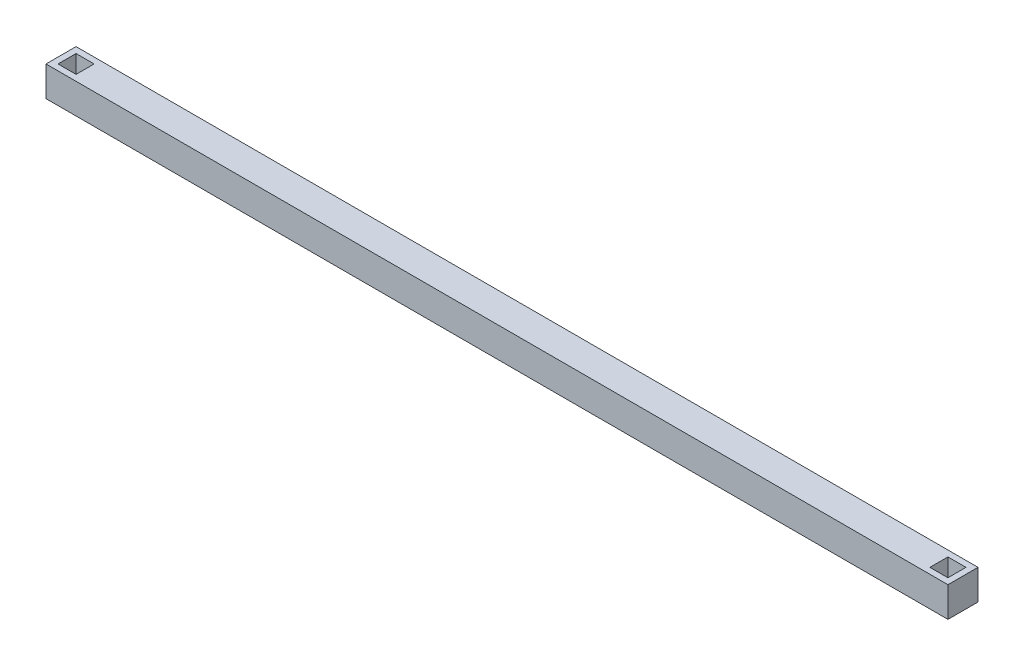
ISO-10303-21;
HEADER;
FILE_DESCRIPTION(('STEP AP214'),'2;1');
FILE_NAME('part.step','',(''),(''),'','','');
FILE_SCHEMA(('AUTOMOTIVE_DESIGN { 1 0 10303 214 1 1 1 1 }'));
ENDSEC;
DATA;
#1=APPLICATION_CONTEXT('core data for automotive mechanical design processes');
#2=APPLICATION_PROTOCOL_DEFINITION('international standard','automotive_design',2000,#1);
#3=PRODUCT_CONTEXT('',#1,'mechanical');
#4=PRODUCT('Part','Part','',(#3));
#5=PRODUCT_RELATED_PRODUCT_CATEGORY('part','',(#4));
#6=PRODUCT_DEFINITION_FORMATION('','',#4);
#7=PRODUCT_DEFINITION_CONTEXT('part definition',#1,'design');
#8=PRODUCT_DEFINITION('design','',#6,#7);
#9=PRODUCT_DEFINITION_SHAPE('','',#8);
#10=(LENGTH_UNIT() NAMED_UNIT(*) SI_UNIT(.MILLI.,.METRE.));
#11=(NAMED_UNIT(*) PLANE_ANGLE_UNIT() SI_UNIT($,.RADIAN.));
#12=(NAMED_UNIT(*) SI_UNIT($,.STERADIAN.) SOLID_ANGLE_UNIT());
#13=UNCERTAINTY_MEASURE_WITH_UNIT(LENGTH_MEASURE(1.E-05),#10,'distance_accuracy_value','');
#14=(GEOMETRIC_REPRESENTATION_CONTEXT(3) GLOBAL_UNCERTAINTY_ASSIGNED_CONTEXT((#13)) GLOBAL_UNIT_ASSIGNED_CONTEXT((#10,
#11,#12)) REPRESENTATION_CONTEXT('',''));
#15=CARTESIAN_POINT('',(0.,0.,0.));
#16=DIRECTION('',(0.,0.,1.));
#17=DIRECTION('',(1.,0.,0.));
#18=AXIS2_PLACEMENT_3D('',#15,#16,#17);
#19=CARTESIAN_POINT('',(-750.,25.,50.));
#20=DIRECTION('',(0.,-1.,0.));
#21=DIRECTION('',(0.,0.,-1.));
#22=AXIS2_PLACEMENT_3D('',#19,#20,#21);
#23=PLANE('',#22);
#24=DIRECTION('',(1.,0.,0.));
#25=VECTOR('',#24,1.);
#26=CARTESIAN_POINT('',(-740.,25.,10.));
#27=LINE('',#26,#25);
#28=CARTESIAN_POINT('',(-740.,25.,10.));
#29=VERTEX_POINT('',#28);
#30=CARTESIAN_POINT('',(-710.,25.,10.));
#31=VERTEX_POINT('',#30);
#32=EDGE_CURVE('E57',#29,#31,#27,.T.);
#33=ORIENTED_EDGE('',*,*,#32,.T.);
#34=DIRECTION('',(0.,0.,1.));
#35=VECTOR('',#34,1.);
#36=CARTESIAN_POINT('',(-710.,25.,10.));
#37=LINE('',#36,#35);
#38=CARTESIAN_POINT('',(-710.,25.,40.));
#39=VERTEX_POINT('',#38);
#40=EDGE_CURVE('E173',#31,#39,#37,.T.);
#41=ORIENTED_EDGE('',*,*,#40,.T.);
#42=DIRECTION('',(1.,0.,0.));
#43=VECTOR('',#42,1.);
#44=CARTESIAN_POINT('',(-740.,25.,40.));
#45=LINE('',#44,#43);
#46=CARTESIAN_POINT('',(-740.,25.,40.));
#47=VERTEX_POINT('',#46);
#48=EDGE_CURVE('E176',#47,#39,#45,.T.);
#49=ORIENTED_EDGE('',*,*,#48,.F.);
#50=DIRECTION('',(0.,0.,1.));
#51=VECTOR('',#50,1.);
#52=CARTESIAN_POINT('',(-740.,25.,10.));
#53=LINE('',#52,#51);
#54=EDGE_CURVE('E163',#29,#47,#53,.T.);
#55=ORIENTED_EDGE('',*,*,#54,.F.);
#56=EDGE_LOOP('',(#33,#41,#49,#55));
#57=FACE_BOUND('',#56,.T.);
#58=DIRECTION('',(-1.,0.,0.));
#59=VECTOR('',#58,1.);
#60=CARTESIAN_POINT('',(-750.,25.,0.));
#61=LINE('',#60,#59);
#62=CARTESIAN_POINT('',(750.,25.,0.));
#63=VERTEX_POINT('',#62);
#64=CARTESIAN_POINT('',(-750.,25.,0.));
#65=VERTEX_POINT('',#64);
#66=EDGE_CURVE('E202',#63,#65,#61,.T.);
#67=ORIENTED_EDGE('',*,*,#66,.T.);
#68=DIRECTION('',(0.,0.,-1.));
#69=VECTOR('',#68,1.);
#70=CARTESIAN_POINT('',(-750.,25.,50.));
#71=LINE('',#70,#69);
#72=CARTESIAN_POINT('',(-750.,25.,50.));
#73=VERTEX_POINT('',#72);
#74=EDGE_CURVE('E42',#73,#65,#71,.T.);
#75=ORIENTED_EDGE('',*,*,#74,.F.);
#76=DIRECTION('',(-1.,0.,0.));
#77=VECTOR('',#76,1.);
#78=CARTESIAN_POINT('',(-750.,25.,50.));
#79=LINE('',#78,#77);
#80=CARTESIAN_POINT('',(750.,25.,50.));
#81=VERTEX_POINT('',#80);
#82=EDGE_CURVE('E192',#81,#73,#79,.T.);
#83=ORIENTED_EDGE('',*,*,#82,.F.);
#84=DIRECTION('',(0.,0.,-1.));
#85=VECTOR('',#84,1.);
#86=CARTESIAN_POINT('',(750.,25.,50.));
#87=LINE('',#86,#85);
#88=EDGE_CURVE('E11',#81,#63,#87,.T.);
#89=ORIENTED_EDGE('',*,*,#88,.T.);
#90=EDGE_LOOP('',(#67,#75,#83,#89));
#91=FACE_BOUND('',#90,.T.);
#92=DIRECTION('',(1.,0.,0.));
#93=VECTOR('',#92,1.);
#94=CARTESIAN_POINT('',(710.,25.,10.));
#95=LINE('',#94,#93);
#96=CARTESIAN_POINT('',(710.,25.,10.));
#97=VERTEX_POINT('',#96);
#98=CARTESIAN_POINT('',(740.,25.,10.));
#99=VERTEX_POINT('',#98);
#100=EDGE_CURVE('E49',#97,#99,#95,.T.);
#101=ORIENTED_EDGE('',*,*,#100,.T.);
#102=DIRECTION('',(0.,0.,1.));
#103=VECTOR('',#102,1.);
#104=CARTESIAN_POINT('',(740.,25.,10.));
#105=LINE('',#104,#103);
#106=CARTESIAN_POINT('',(740.,25.,40.));
#107=VERTEX_POINT('',#106);
#108=EDGE_CURVE('E146',#99,#107,#105,.T.);
#109=ORIENTED_EDGE('',*,*,#108,.T.);
#110=DIRECTION('',(1.,0.,0.));
#111=VECTOR('',#110,1.);
#112=CARTESIAN_POINT('',(710.,25.,40.));
#113=LINE('',#112,#111);
#114=CARTESIAN_POINT('',(710.,25.,40.));
#115=VERTEX_POINT('',#114);
#116=EDGE_CURVE('E130',#115,#107,#113,.T.);
#117=ORIENTED_EDGE('',*,*,#116,.F.);
#118=DIRECTION('',(0.,0.,1.));
#119=VECTOR('',#118,1.);
#120=CARTESIAN_POINT('',(710.,25.,10.));
#121=LINE('',#120,#119);
#122=EDGE_CURVE('E141',#97,#115,#121,.T.);
#123=ORIENTED_EDGE('',*,*,#122,.F.);
#124=EDGE_LOOP('',(#101,#109,#117,#123));
#125=FACE_BOUND('',#124,.T.);
#126=ADVANCED_FACE('F34',(#57,#91,#125),#23,.F.);
#127=CARTESIAN_POINT('',(750.,25.,50.));
#128=DIRECTION('',(-1.,0.,0.));
#129=DIRECTION('',(0.,0.,1.));
#130=AXIS2_PLACEMENT_3D('',#127,#128,#129);
#131=PLANE('',#130);
#132=DIRECTION('',(0.,1.,0.));
#133=VECTOR('',#132,1.);
#134=CARTESIAN_POINT('',(750.,25.,0.));
#135=LINE('',#134,#133);
#136=CARTESIAN_POINT('',(750.,-25.,0.));
#137=VERTEX_POINT('',#136);
#138=EDGE_CURVE('E188',#137,#63,#135,.T.);
#139=ORIENTED_EDGE('',*,*,#138,.T.);
#140=ORIENTED_EDGE('',*,*,#88,.F.);
#141=DIRECTION('',(0.,1.,0.));
#142=VECTOR('',#141,1.);
#143=CARTESIAN_POINT('',(750.,25.,50.));
#144=LINE('',#143,#142);
#145=CARTESIAN_POINT('',(750.,-25.,50.));
#146=VERTEX_POINT('',#145);
#147=EDGE_CURVE('E189',#146,#81,#144,.T.);
#148=ORIENTED_EDGE('',*,*,#147,.F.);
#149=DIRECTION('',(0.,0.,-1.));
#150=VECTOR('',#149,1.);
#151=CARTESIAN_POINT('',(750.,-25.,50.));
#152=LINE('',#151,#150);
#153=EDGE_CURVE('E199',#146,#137,#152,.T.);
#154=ORIENTED_EDGE('',*,*,#153,.T.);
#155=EDGE_LOOP('',(#139,#140,#148,#154));
#156=FACE_BOUND('',#155,.T.);
#157=ADVANCED_FACE('F36',(#156),#131,.F.);
#158=CARTESIAN_POINT('',(-750.,25.,50.));
#159=DIRECTION('',(1.,0.,0.));
#160=DIRECTION('',(0.,0.,-1.));
#161=AXIS2_PLACEMENT_3D('',#158,#159,#160);
#162=PLANE('',#161);
#163=DIRECTION('',(0.,-1.,0.));
#164=VECTOR('',#163,1.);
#165=CARTESIAN_POINT('',(-750.,25.,0.));
#166=LINE('',#165,#164);
#167=CARTESIAN_POINT('',(-750.,-25.,0.));
#168=VERTEX_POINT('',#167);
#169=EDGE_CURVE('E204',#65,#168,#166,.T.);
#170=ORIENTED_EDGE('',*,*,#169,.T.);
#171=DIRECTION('',(0.,0.,-1.));
#172=VECTOR('',#171,1.);
#173=CARTESIAN_POINT('',(-750.,-25.,50.));
#174=LINE('',#173,#172);
#175=CARTESIAN_POINT('',(-750.,-25.,50.));
#176=VERTEX_POINT('',#175);
#177=EDGE_CURVE('E209',#176,#168,#174,.T.);
#178=ORIENTED_EDGE('',*,*,#177,.F.);
#179=DIRECTION('',(0.,-1.,0.));
#180=VECTOR('',#179,1.);
#181=CARTESIAN_POINT('',(-750.,25.,50.));
#182=LINE('',#181,#180);
#183=EDGE_CURVE('E195',#73,#176,#182,.T.);
#184=ORIENTED_EDGE('',*,*,#183,.F.);
#185=ORIENTED_EDGE('',*,*,#74,.T.);
#186=EDGE_LOOP('',(#170,#178,#184,#185));
#187=FACE_BOUND('',#186,.T.);
#188=ADVANCED_FACE('F216',(#187),#162,.F.);
#189=CARTESIAN_POINT('',(-750.,-25.,50.));
#190=DIRECTION('',(0.,1.,0.));
#191=DIRECTION('',(0.,0.,1.));
#192=AXIS2_PLACEMENT_3D('',#189,#190,#191);
#193=PLANE('',#192);
#194=DIRECTION('',(1.,0.,0.));
#195=VECTOR('',#194,1.);
#196=CARTESIAN_POINT('',(-750.,-25.,0.));
#197=LINE('',#196,#195);
#198=EDGE_CURVE('E193',#168,#137,#197,.T.);
#199=ORIENTED_EDGE('',*,*,#198,.T.);
#200=ORIENTED_EDGE('',*,*,#153,.F.);
#201=DIRECTION('',(1.,0.,0.));
#202=VECTOR('',#201,1.);
#203=CARTESIAN_POINT('',(-750.,-25.,50.));
#204=LINE('',#203,#202);
#205=EDGE_CURVE('E197',#176,#146,#204,.T.);
#206=ORIENTED_EDGE('',*,*,#205,.F.);
#207=ORIENTED_EDGE('',*,*,#177,.T.);
#208=EDGE_LOOP('',(#199,#200,#206,#207));
#209=FACE_BOUND('',#208,.T.);
#210=ADVANCED_FACE('F225',(#209),#193,.F.);
#211=CARTESIAN_POINT('',(0.,0.,50.));
#212=DIRECTION('',(0.,0.,1.));
#213=DIRECTION('',(1.,0.,0.));
#214=AXIS2_PLACEMENT_3D('',#211,#212,#213);
#215=PLANE('',#214);
#216=ORIENTED_EDGE('',*,*,#147,.T.);
#217=ORIENTED_EDGE('',*,*,#82,.T.);
#218=ORIENTED_EDGE('',*,*,#183,.T.);
#219=ORIENTED_EDGE('',*,*,#205,.T.);
#220=EDGE_LOOP('',(#216,#217,#218,#219));
#221=FACE_BOUND('',#220,.T.);
#222=ADVANCED_FACE('F231',(#221),#215,.T.);
#223=CARTESIAN_POINT('',(0.,0.,0.));
#224=DIRECTION('',(0.,0.,1.));
#225=DIRECTION('',(1.,0.,0.));
#226=AXIS2_PLACEMENT_3D('',#223,#224,#225);
#227=PLANE('',#226);
#228=ORIENTED_EDGE('',*,*,#138,.F.);
#229=ORIENTED_EDGE('',*,*,#198,.F.);
#230=ORIENTED_EDGE('',*,*,#169,.F.);
#231=ORIENTED_EDGE('',*,*,#66,.F.);
#232=EDGE_LOOP('',(#228,#229,#230,#231));
#233=FACE_BOUND('',#232,.T.);
#234=ADVANCED_FACE('F222',(#233),#227,.F.);
#235=CARTESIAN_POINT('',(-740.,-5.,10.));
#236=DIRECTION('',(0.,0.,1.));
#237=DIRECTION('',(1.,0.,0.));
#238=AXIS2_PLACEMENT_3D('',#235,#236,#237);
#239=PLANE('',#238);
#240=ORIENTED_EDGE('',*,*,#32,.F.);
#241=DIRECTION('',(0.,1.,0.));
#242=VECTOR('',#241,1.);
#243=CARTESIAN_POINT('',(-740.,-5.,10.));
#244=LINE('',#243,#242);
#245=CARTESIAN_POINT('',(-740.,-5.,10.));
#246=VERTEX_POINT('',#245);
#247=EDGE_CURVE('E171',#246,#29,#244,.T.);
#248=ORIENTED_EDGE('',*,*,#247,.F.);
#249=DIRECTION('',(1.,0.,0.));
#250=VECTOR('',#249,1.);
#251=CARTESIAN_POINT('',(-740.,-5.,10.));
#252=LINE('',#251,#250);
#253=CARTESIAN_POINT('',(-710.,-5.,10.));
#254=VERTEX_POINT('',#253);
#255=EDGE_CURVE('E159',#246,#254,#252,.T.);
#256=ORIENTED_EDGE('',*,*,#255,.T.);
#257=DIRECTION('',(0.,1.,0.));
#258=VECTOR('',#257,1.);
#259=CARTESIAN_POINT('',(-710.,-5.,10.));
#260=LINE('',#259,#258);
#261=EDGE_CURVE('E186',#254,#31,#260,.T.);
#262=ORIENTED_EDGE('',*,*,#261,.T.);
#263=EDGE_LOOP('',(#240,#248,#256,#262));
#264=FACE_BOUND('',#263,.T.);
#265=ADVANCED_FACE('F244',(#264),#239,.T.);
#266=CARTESIAN_POINT('',(-710.,-5.,10.));
#267=DIRECTION('',(-1.,0.,0.));
#268=DIRECTION('',(0.,0.,1.));
#269=AXIS2_PLACEMENT_3D('',#266,#267,#268);
#270=PLANE('',#269);
#271=ORIENTED_EDGE('',*,*,#40,.F.);
#272=ORIENTED_EDGE('',*,*,#261,.F.);
#273=DIRECTION('',(0.,0.,1.));
#274=VECTOR('',#273,1.);
#275=CARTESIAN_POINT('',(-710.,-5.,10.));
#276=LINE('',#275,#274);
#277=CARTESIAN_POINT('',(-710.,-5.,40.));
#278=VERTEX_POINT('',#277);
#279=EDGE_CURVE('E162',#254,#278,#276,.T.);
#280=ORIENTED_EDGE('',*,*,#279,.T.);
#281=DIRECTION('',(0.,1.,0.));
#282=VECTOR('',#281,1.);
#283=CARTESIAN_POINT('',(-710.,-5.,40.));
#284=LINE('',#283,#282);
#285=EDGE_CURVE('E184',#278,#39,#284,.T.);
#286=ORIENTED_EDGE('',*,*,#285,.T.);
#287=EDGE_LOOP('',(#271,#272,#280,#286));
#288=FACE_BOUND('',#287,.T.);
#289=ADVANCED_FACE('F249',(#288),#270,.T.);
#290=CARTESIAN_POINT('',(-740.,-5.,40.));
#291=DIRECTION('',(0.,0.,1.));
#292=DIRECTION('',(1.,0.,0.));
#293=AXIS2_PLACEMENT_3D('',#290,#291,#292);
#294=PLANE('',#293);
#295=ORIENTED_EDGE('',*,*,#48,.T.);
#296=ORIENTED_EDGE('',*,*,#285,.F.);
#297=DIRECTION('',(1.,0.,0.));
#298=VECTOR('',#297,1.);
#299=CARTESIAN_POINT('',(-740.,-5.,40.));
#300=LINE('',#299,#298);
#301=CARTESIAN_POINT('',(-740.,-5.,40.));
#302=VERTEX_POINT('',#301);
#303=EDGE_CURVE('E165',#302,#278,#300,.T.);
#304=ORIENTED_EDGE('',*,*,#303,.F.);
#305=DIRECTION('',(0.,1.,0.));
#306=VECTOR('',#305,1.);
#307=CARTESIAN_POINT('',(-740.,-5.,40.));
#308=LINE('',#307,#306);
#309=EDGE_CURVE('E182',#302,#47,#308,.T.);
#310=ORIENTED_EDGE('',*,*,#309,.T.);
#311=EDGE_LOOP('',(#295,#296,#304,#310));
#312=FACE_BOUND('',#311,.T.);
#313=ADVANCED_FACE('F252',(#312),#294,.F.);
#314=CARTESIAN_POINT('',(-740.,-5.,10.));
#315=DIRECTION('',(-1.,0.,0.));
#316=DIRECTION('',(0.,0.,1.));
#317=AXIS2_PLACEMENT_3D('',#314,#315,#316);
#318=PLANE('',#317);
#319=ORIENTED_EDGE('',*,*,#54,.T.);
#320=ORIENTED_EDGE('',*,*,#309,.F.);
#321=DIRECTION('',(0.,0.,1.));
#322=VECTOR('',#321,1.);
#323=CARTESIAN_POINT('',(-740.,-5.,10.));
#324=LINE('',#323,#322);
#325=EDGE_CURVE('E168',#246,#302,#324,.T.);
#326=ORIENTED_EDGE('',*,*,#325,.F.);
#327=ORIENTED_EDGE('',*,*,#247,.T.);
#328=EDGE_LOOP('',(#319,#320,#326,#327));
#329=FACE_BOUND('',#328,.T.);
#330=ADVANCED_FACE('F256',(#329),#318,.F.);
#331=CARTESIAN_POINT('',(0.,-5.,0.));
#332=DIRECTION('',(0.,-1.,0.));
#333=DIRECTION('',(0.,0.,-1.));
#334=AXIS2_PLACEMENT_3D('',#331,#332,#333);
#335=PLANE('',#334);
#336=ORIENTED_EDGE('',*,*,#255,.F.);
#337=ORIENTED_EDGE('',*,*,#325,.T.);
#338=ORIENTED_EDGE('',*,*,#303,.T.);
#339=ORIENTED_EDGE('',*,*,#279,.F.);
#340=EDGE_LOOP('',(#336,#337,#338,#339));
#341=FACE_BOUND('',#340,.T.);
#342=ADVANCED_FACE('F260',(#341),#335,.F.);
#343=CARTESIAN_POINT('',(710.,-5.,10.));
#344=DIRECTION('',(0.,0.,1.));
#345=DIRECTION('',(1.,0.,0.));
#346=AXIS2_PLACEMENT_3D('',#343,#344,#345);
#347=PLANE('',#346);
#348=ORIENTED_EDGE('',*,*,#100,.F.);
#349=DIRECTION('',(0.,1.,0.));
#350=VECTOR('',#349,1.);
#351=CARTESIAN_POINT('',(710.,-5.,10.));
#352=LINE('',#351,#350);
#353=CARTESIAN_POINT('',(710.,-5.,10.));
#354=VERTEX_POINT('',#353);
#355=EDGE_CURVE('E137',#354,#97,#352,.T.);
#356=ORIENTED_EDGE('',*,*,#355,.F.);
#357=DIRECTION('',(1.,0.,0.));
#358=VECTOR('',#357,1.);
#359=CARTESIAN_POINT('',(710.,-5.,10.));
#360=LINE('',#359,#358);
#361=CARTESIAN_POINT('',(740.,-5.,10.));
#362=VERTEX_POINT('',#361);
#363=EDGE_CURVE('E144',#354,#362,#360,.T.);
#364=ORIENTED_EDGE('',*,*,#363,.T.);
#365=DIRECTION('',(0.,1.,0.));
#366=VECTOR('',#365,1.);
#367=CARTESIAN_POINT('',(740.,-5.,10.));
#368=LINE('',#367,#366);
#369=EDGE_CURVE('E374',#362,#99,#368,.T.);
#370=ORIENTED_EDGE('',*,*,#369,.T.);
#371=EDGE_LOOP('',(#348,#356,#364,#370));
#372=FACE_BOUND('',#371,.T.);
#373=ADVANCED_FACE('F264',(#372),#347,.T.);
#374=CARTESIAN_POINT('',(740.,-5.,10.));
#375=DIRECTION('',(-1.,0.,0.));
#376=DIRECTION('',(0.,0.,1.));
#377=AXIS2_PLACEMENT_3D('',#374,#375,#376);
#378=PLANE('',#377);
#379=ORIENTED_EDGE('',*,*,#108,.F.);
#380=ORIENTED_EDGE('',*,*,#369,.F.);
#381=DIRECTION('',(0.,0.,1.));
#382=VECTOR('',#381,1.);
#383=CARTESIAN_POINT('',(740.,-5.,10.));
#384=LINE('',#383,#382);
#385=CARTESIAN_POINT('',(740.,-5.,40.));
#386=VERTEX_POINT('',#385);
#387=EDGE_CURVE('E155',#362,#386,#384,.T.);
#388=ORIENTED_EDGE('',*,*,#387,.T.);
#389=DIRECTION('',(0.,1.,0.));
#390=VECTOR('',#389,1.);
#391=CARTESIAN_POINT('',(740.,-5.,40.));
#392=LINE('',#391,#390);
#393=EDGE_CURVE('E138',#386,#107,#392,.T.);
#394=ORIENTED_EDGE('',*,*,#393,.T.);
#395=EDGE_LOOP('',(#379,#380,#388,#394));
#396=FACE_BOUND('',#395,.T.);
#397=ADVANCED_FACE('F274',(#396),#378,.T.);
#398=CARTESIAN_POINT('',(710.,-5.,40.));
#399=DIRECTION('',(0.,0.,1.));
#400=DIRECTION('',(1.,0.,0.));
#401=AXIS2_PLACEMENT_3D('',#398,#399,#400);
#402=PLANE('',#401);
#403=ORIENTED_EDGE('',*,*,#116,.T.);
#404=ORIENTED_EDGE('',*,*,#393,.F.);
#405=DIRECTION('',(1.,0.,0.));
#406=VECTOR('',#405,1.);
#407=CARTESIAN_POINT('',(710.,-5.,40.));
#408=LINE('',#407,#406);
#409=CARTESIAN_POINT('',(710.,-5.,40.));
#410=VERTEX_POINT('',#409);
#411=EDGE_CURVE('E133',#410,#386,#408,.T.);
#412=ORIENTED_EDGE('',*,*,#411,.F.);
#413=DIRECTION('',(0.,1.,0.));
#414=VECTOR('',#413,1.);
#415=CARTESIAN_POINT('',(710.,-5.,40.));
#416=LINE('',#415,#414);
#417=EDGE_CURVE('E125',#410,#115,#416,.T.);
#418=ORIENTED_EDGE('',*,*,#417,.T.);
#419=EDGE_LOOP('',(#403,#404,#412,#418));
#420=FACE_BOUND('',#419,.T.);
#421=ADVANCED_FACE('F127',(#420),#402,.F.);
#422=CARTESIAN_POINT('',(710.,-5.,10.));
#423=DIRECTION('',(-1.,0.,0.));
#424=DIRECTION('',(0.,0.,1.));
#425=AXIS2_PLACEMENT_3D('',#422,#423,#424);
#426=PLANE('',#425);
#427=ORIENTED_EDGE('',*,*,#122,.T.);
#428=ORIENTED_EDGE('',*,*,#417,.F.);
#429=DIRECTION('',(0.,0.,1.));
#430=VECTOR('',#429,1.);
#431=CARTESIAN_POINT('',(710.,-5.,10.));
#432=LINE('',#431,#430);
#433=EDGE_CURVE('E152',#354,#410,#432,.T.);
#434=ORIENTED_EDGE('',*,*,#433,.F.);
#435=ORIENTED_EDGE('',*,*,#355,.T.);
#436=EDGE_LOOP('',(#427,#428,#434,#435));
#437=FACE_BOUND('',#436,.T.);
#438=ADVANCED_FACE('F142',(#437),#426,.F.);
#439=CARTESIAN_POINT('',(0.,-5.,0.));
#440=DIRECTION('',(0.,-1.,0.));
#441=DIRECTION('',(0.,0.,-1.));
#442=AXIS2_PLACEMENT_3D('',#439,#440,#441);
#443=PLANE('',#442);
#444=ORIENTED_EDGE('',*,*,#363,.F.);
#445=ORIENTED_EDGE('',*,*,#433,.T.);
#446=ORIENTED_EDGE('',*,*,#411,.T.);
#447=ORIENTED_EDGE('',*,*,#387,.F.);
#448=EDGE_LOOP('',(#444,#445,#446,#447));
#449=FACE_BOUND('',#448,.T.);
#450=ADVANCED_FACE('F266',(#449),#443,.F.);
#451=CLOSED_SHELL('',(#126,#157,#188,#210,#222,#234,#265,#289,#313,#330,#342,#373,#397,#421,
#438,#450));
#452=MANIFOLD_SOLID_BREP('B2',#451);
#453=ADVANCED_BREP_SHAPE_REPRESENTATION('',(#18,#452),#14);
#454=SHAPE_DEFINITION_REPRESENTATION(#9,#453);
ENDSEC;
END-ISO-10303-21;
